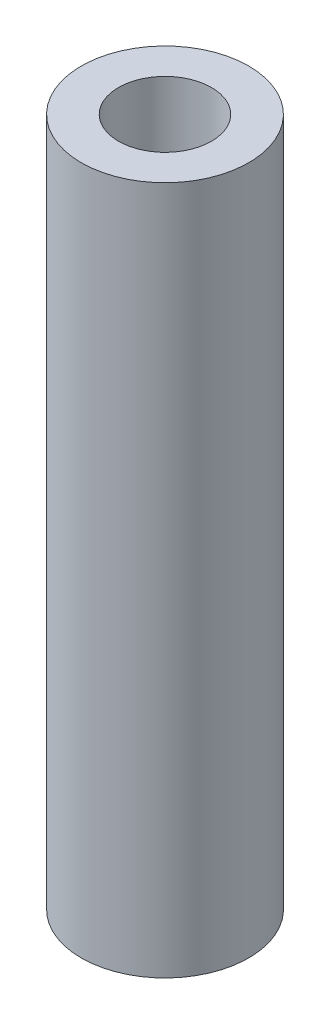
ISO-10303-21;
HEADER;
FILE_DESCRIPTION(('STEP AP214'),'2;1');
FILE_NAME('part.step','',(''),(''),'','','');
FILE_SCHEMA(('AUTOMOTIVE_DESIGN { 1 0 10303 214 1 1 1 1 }'));
ENDSEC;
DATA;
#1=APPLICATION_CONTEXT('core data for automotive mechanical design processes');
#2=APPLICATION_PROTOCOL_DEFINITION('international standard','automotive_design',2000,#1);
#3=PRODUCT_CONTEXT('',#1,'mechanical');
#4=PRODUCT('Part','Part','',(#3));
#5=PRODUCT_RELATED_PRODUCT_CATEGORY('part','',(#4));
#6=PRODUCT_DEFINITION_FORMATION('','',#4);
#7=PRODUCT_DEFINITION_CONTEXT('part definition',#1,'design');
#8=PRODUCT_DEFINITION('design','',#6,#7);
#9=PRODUCT_DEFINITION_SHAPE('','',#8);
#10=(LENGTH_UNIT() NAMED_UNIT(*) SI_UNIT(.MILLI.,.METRE.));
#11=(NAMED_UNIT(*) PLANE_ANGLE_UNIT() SI_UNIT($,.RADIAN.));
#12=(NAMED_UNIT(*) SI_UNIT($,.STERADIAN.) SOLID_ANGLE_UNIT());
#13=UNCERTAINTY_MEASURE_WITH_UNIT(LENGTH_MEASURE(1.E-05),#10,'distance_accuracy_value','');
#14=(GEOMETRIC_REPRESENTATION_CONTEXT(3) GLOBAL_UNCERTAINTY_ASSIGNED_CONTEXT((#13)) GLOBAL_UNIT_ASSIGNED_CONTEXT((#10,
#11,#12)) REPRESENTATION_CONTEXT('',''));
#15=CARTESIAN_POINT('',(0.,0.,0.));
#16=DIRECTION('',(0.,0.,1.));
#17=DIRECTION('',(1.,0.,0.));
#18=AXIS2_PLACEMENT_3D('',#15,#16,#17);
#19=CARTESIAN_POINT('',(44.4951474599724,18.4999999999985,24.));
#20=DIRECTION('',(0.,1.,0.));
#21=DIRECTION('',(1.,0.,0.));
#22=AXIS2_PLACEMENT_3D('',#19,#20,#21);
#23=PLANE('',#22);
#24=CARTESIAN_POINT('',(0.,18.4999999999985,0.));
#25=DIRECTION('',(0.,1.,0.));
#26=DIRECTION('',(1.,0.,0.));
#27=AXIS2_PLACEMENT_3D('',#24,#25,#26);
#28=CIRCLE('',#27,2.5);
#29=CARTESIAN_POINT('',(2.5,18.4999999999985,0.));
#30=VERTEX_POINT('',#29);
#31=EDGE_CURVE('E42',#30,#30,#28,.T.);
#32=ORIENTED_EDGE('',*,*,#31,.F.);
#33=EDGE_LOOP('',(#32));
#34=FACE_BOUND('',#33,.T.);
#35=CARTESIAN_POINT('',(0.,18.4999999999985,0.));
#36=DIRECTION('',(0.,1.,0.));
#37=DIRECTION('',(0.,0.,1.));
#38=AXIS2_PLACEMENT_3D('',#35,#36,#37);
#39=CIRCLE('',#38,4.5);
#40=CARTESIAN_POINT('',(0.,18.4999999999985,4.5));
#41=VERTEX_POINT('',#40);
#42=EDGE_CURVE('E10',#41,#41,#39,.T.);
#43=ORIENTED_EDGE('',*,*,#42,.T.);
#44=EDGE_LOOP('',(#43));
#45=FACE_BOUND('',#44,.T.);
#46=ADVANCED_FACE('F35',(#34,#45),#23,.T.);
#47=CARTESIAN_POINT('',(0.,0.5,0.));
#48=DIRECTION('',(0.,-1.,0.));
#49=DIRECTION('',(0.,0.,-1.));
#50=AXIS2_PLACEMENT_3D('',#47,#48,#49);
#51=CYLINDRICAL_SURFACE('',#50,2.5);
#52=CARTESIAN_POINT('',(0.,-18.4999999999995,0.));
#53=DIRECTION('',(0.,1.,0.));
#54=DIRECTION('',(1.,0.,0.));
#55=AXIS2_PLACEMENT_3D('',#52,#53,#54);
#56=CIRCLE('',#55,2.5);
#57=CARTESIAN_POINT('',(2.5,-18.4999999999995,0.));
#58=VERTEX_POINT('',#57);
#59=EDGE_CURVE('E50',#58,#58,#56,.T.);
#60=ORIENTED_EDGE('',*,*,#59,.F.);
#61=EDGE_LOOP('',(#60));
#62=FACE_BOUND('',#61,.T.);
#63=ORIENTED_EDGE('',*,*,#31,.T.);
#64=EDGE_LOOP('',(#63));
#65=FACE_BOUND('',#64,.T.);
#66=ADVANCED_FACE('F58',(#62,#65),#51,.F.);
#67=CARTESIAN_POINT('',(0.,0.5,0.));
#68=DIRECTION('',(0.,-1.,0.));
#69=DIRECTION('',(0.,0.,-1.));
#70=AXIS2_PLACEMENT_3D('',#67,#68,#69);
#71=CYLINDRICAL_SURFACE('',#70,4.5);
#72=CARTESIAN_POINT('',(0.,-18.4999999999995,0.));
#73=DIRECTION('',(0.,1.,0.));
#74=DIRECTION('',(0.,0.,1.));
#75=AXIS2_PLACEMENT_3D('',#72,#73,#74);
#76=CIRCLE('',#75,4.5);
#77=CARTESIAN_POINT('',(0.,-18.4999999999995,4.5));
#78=VERTEX_POINT('',#77);
#79=EDGE_CURVE('E46',#78,#78,#76,.F.);
#80=ORIENTED_EDGE('',*,*,#79,.F.);
#81=EDGE_LOOP('',(#80));
#82=FACE_BOUND('',#81,.T.);
#83=ORIENTED_EDGE('',*,*,#42,.F.);
#84=EDGE_LOOP('',(#83));
#85=FACE_BOUND('',#84,.T.);
#86=ADVANCED_FACE('F37',(#82,#85),#71,.T.);
#87=CARTESIAN_POINT('',(44.4951474599724,-18.4999999999995,24.));
#88=DIRECTION('',(0.,1.,0.));
#89=DIRECTION('',(1.,0.,0.));
#90=AXIS2_PLACEMENT_3D('',#87,#88,#89);
#91=PLANE('',#90);
#92=ORIENTED_EDGE('',*,*,#79,.T.);
#93=EDGE_LOOP('',(#92));
#94=FACE_BOUND('',#93,.T.);
#95=ORIENTED_EDGE('',*,*,#59,.T.);
#96=EDGE_LOOP('',(#95));
#97=FACE_BOUND('',#96,.T.);
#98=ADVANCED_FACE('F56',(#94,#97),#91,.F.);
#99=CLOSED_SHELL('',(#46,#66,#86,#98));
#100=MANIFOLD_SOLID_BREP('B2',#99);
#101=ADVANCED_BREP_SHAPE_REPRESENTATION('',(#18,#100),#14);
#102=SHAPE_DEFINITION_REPRESENTATION(#9,#101);
ENDSEC;
END-ISO-10303-21;
